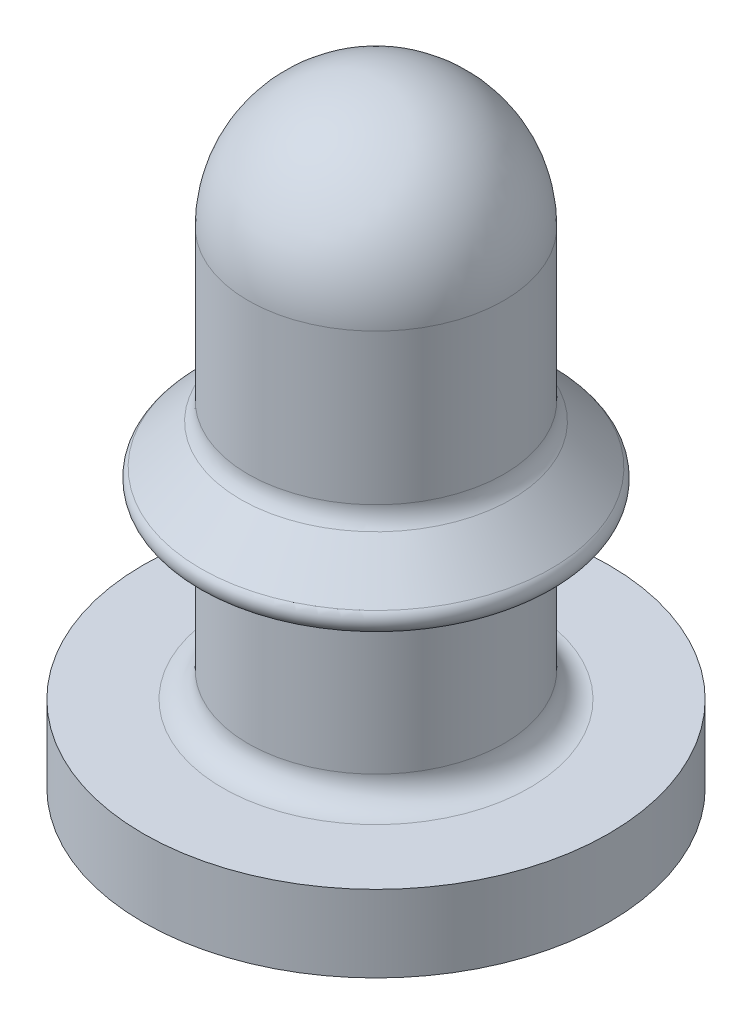
ISO-10303-21;
HEADER;
FILE_DESCRIPTION(('STEP AP214'),'2;1');
FILE_NAME('part.step','',(''),(''),'','','');
FILE_SCHEMA(('AUTOMOTIVE_DESIGN { 1 0 10303 214 1 1 1 1 }'));
ENDSEC;
DATA;
#1=APPLICATION_CONTEXT('core data for automotive mechanical design processes');
#2=APPLICATION_PROTOCOL_DEFINITION('international standard','automotive_design',2000,#1);
#3=PRODUCT_CONTEXT('',#1,'mechanical');
#4=PRODUCT('Part','Part','',(#3));
#5=PRODUCT_RELATED_PRODUCT_CATEGORY('part','',(#4));
#6=PRODUCT_DEFINITION_FORMATION('','',#4);
#7=PRODUCT_DEFINITION_CONTEXT('part definition',#1,'design');
#8=PRODUCT_DEFINITION('design','',#6,#7);
#9=PRODUCT_DEFINITION_SHAPE('','',#8);
#10=(LENGTH_UNIT() NAMED_UNIT(*) SI_UNIT(.MILLI.,.METRE.));
#11=(NAMED_UNIT(*) PLANE_ANGLE_UNIT() SI_UNIT($,.RADIAN.));
#12=(NAMED_UNIT(*) SI_UNIT($,.STERADIAN.) SOLID_ANGLE_UNIT());
#13=UNCERTAINTY_MEASURE_WITH_UNIT(LENGTH_MEASURE(1.E-05),#10,'distance_accuracy_value','');
#14=(GEOMETRIC_REPRESENTATION_CONTEXT(3) GLOBAL_UNCERTAINTY_ASSIGNED_CONTEXT((#13)) GLOBAL_UNIT_ASSIGNED_CONTEXT((#10,
#11,#12)) REPRESENTATION_CONTEXT('',''));
#15=CARTESIAN_POINT('',(0.,0.,0.));
#16=DIRECTION('',(0.,0.,1.));
#17=DIRECTION('',(1.,0.,0.));
#18=AXIS2_PLACEMENT_3D('',#15,#16,#17);
#19=CARTESIAN_POINT('',(0.,0.,0.));
#20=DIRECTION('',(0.,1.,0.));
#21=DIRECTION('',(0.,0.,1.));
#22=AXIS2_PLACEMENT_3D('',#19,#20,#21);
#23=PLANE('',#22);
#24=CARTESIAN_POINT('',(0.,0.,0.));
#25=DIRECTION('',(0.,-1.,0.));
#26=DIRECTION('',(0.,0.,-1.));
#27=AXIS2_PLACEMENT_3D('',#24,#25,#26);
#28=CIRCLE('',#27,4.55);
#29=CARTESIAN_POINT('',(0.,0.,-4.55));
#30=VERTEX_POINT('',#29);
#31=EDGE_CURVE('E222',#30,#30,#28,.T.);
#32=ORIENTED_EDGE('',*,*,#31,.T.);
#33=EDGE_LOOP('',(#32));
#34=FACE_BOUND('',#33,.T.);
#35=CARTESIAN_POINT('',(0.,0.,0.));
#36=DIRECTION('',(0.,1.,0.));
#37=DIRECTION('',(-1.,0.,0.));
#38=AXIS2_PLACEMENT_3D('',#35,#36,#37);
#39=CIRCLE('',#38,1.17455064928218);
#40=CARTESIAN_POINT('',(-0.778036246491997,0.,0.879902737166914));
#41=VERTEX_POINT('',#40);
#42=CARTESIAN_POINT('',(-0.37299999999999,0.,1.11375052311062));
#43=VERTEX_POINT('',#42);
#44=EDGE_CURVE('E120',#41,#43,#39,.T.);
#45=ORIENTED_EDGE('',*,*,#44,.T.);
#46=CARTESIAN_POINT('',(0.,0.,0.));
#47=DIRECTION('',(0.,1.,0.));
#48=DIRECTION('',(0.,0.,1.));
#49=AXIS2_PLACEMENT_3D('',#46,#47,#48);
#50=CIRCLE('',#49,1.17455064928218);
#51=CARTESIAN_POINT('',(1.15103624649201,0.,0.233847785943715));
#52=VERTEX_POINT('',#51);
#53=EDGE_CURVE('E230',#52,#43,#50,.F.);
#54=ORIENTED_EDGE('',*,*,#53,.F.);
#55=CARTESIAN_POINT('',(1.15103624649201,0.,-0.233847785943715));
#56=VERTEX_POINT('',#55);
#57=EDGE_CURVE('E600',#52,#56,#39,.T.);
#58=ORIENTED_EDGE('',*,*,#57,.T.);
#59=CARTESIAN_POINT('',(-0.373000000000006,0.,-1.11375052311062));
#60=VERTEX_POINT('',#59);
#61=EDGE_CURVE('E234',#60,#56,#50,.F.);
#62=ORIENTED_EDGE('',*,*,#61,.F.);
#63=CARTESIAN_POINT('',(-0.778036246492009,0.,-0.879902737166903));
#64=VERTEX_POINT('',#63);
#65=EDGE_CURVE('E598',#60,#64,#39,.T.);
#66=ORIENTED_EDGE('',*,*,#65,.T.);
#67=EDGE_CURVE('E233',#41,#64,#50,.F.);
#68=ORIENTED_EDGE('',*,*,#67,.F.);
#69=EDGE_LOOP('',(#45,#54,#58,#62,#66,#68));
#70=FACE_BOUND('',#69,.T.);
#71=ADVANCED_FACE('F41',(#34,#70),#23,.F.);
#72=CARTESIAN_POINT('',(0.746,-0.634345967878164,0.));
#73=DIRECTION('',(0.499999999999999,0.,0.866025403784439));
#74=DIRECTION('',(0.866025403784439,0.,-0.5));
#75=AXIS2_PLACEMENT_3D('',#72,#73,#74);
#76=PLANE('',#75);
#77=CARTESIAN_POINT('',(0.745832173779802,0.510926775890563,9.68945134081906E-05));
#78=CARTESIAN_POINT('',(0.78062302744479,0.469413521310681,-0.0199896142154092));
#79=CARTESIAN_POINT('',(0.815040850569823,0.427491240145489,-0.0398607536615681));
#80=CARTESIAN_POINT('',(0.883320839870301,0.343055748477382,-0.0792822238644636));
#81=CARTESIAN_POINT('',(0.917183070800882,0.300542607922312,-0.0988325920075956));
#82=CARTESIAN_POINT('',(0.984547959411344,0.215145709563048,-0.137725728580775));
#83=CARTESIAN_POINT('',(1.01805064251247,0.172261978353071,-0.157068511687784));
#84=CARTESIAN_POINT('',(1.08479437485192,0.0862148431036361,-0.195603023520688));
#85=CARTESIAN_POINT('',(1.11803539377236,0.0430514076824374,-0.214794734742543));
#86=CARTESIAN_POINT('',(1.15118951555644,-0.000200000000000043,-0.233936275879324));
#87=B_SPLINE_CURVE_WITH_KNOTS('',3,(#77,#78,#79,#80,#81,#82,#83,#84,#85,#86),.UNSPECIFIED.,.F.,
.F.,(4,2,2,2,4),(0.,0.173295083895832,0.346569824409935,0.519832232017379,0.693114427717982),.UNSPECIFIED.);
#88=CARTESIAN_POINT('',(0.746,0.510726775890617,0.));
#89=VERTEX_POINT('',#88);
#90=EDGE_CURVE('E134',#89,#56,#87,.T.);
#91=ORIENTED_EDGE('',*,*,#90,.F.);
#92=DIRECTION('',(0.,1.,0.));
#93=VECTOR('',#92,1.);
#94=CARTESIAN_POINT('',(0.746,-0.634345967878164,0.));
#95=LINE('',#94,#93);
#96=CARTESIAN_POINT('',(0.746,10.,0.));
#97=VERTEX_POINT('',#96);
#98=EDGE_CURVE('E583',#89,#97,#95,.T.);
#99=ORIENTED_EDGE('',*,*,#98,.T.);
#100=DIRECTION('',(0.866025403784439,0.,-0.499999999999999));
#101=VECTOR('',#100,1.);
#102=CARTESIAN_POINT('',(0.746,10.,0.));
#103=LINE('',#102,#101);
#104=CARTESIAN_POINT('',(0.990025512973919,10.,-0.140888195604629));
#105=VERTEX_POINT('',#104);
#106=EDGE_CURVE('E538',#97,#105,#103,.T.);
#107=ORIENTED_EDGE('',*,*,#106,.T.);
#108=CARTESIAN_POINT('',(0.990022254508027,10.0002,-0.140886314328468));
#109=CARTESIAN_POINT('',(1.00069504923594,9.34508688925258,-0.147048255237634));
#110=CARTESIAN_POINT('',(1.01133909204178,8.6899731550503,-0.153193596216853));
#111=CARTESIAN_POINT('',(1.04366157079037,6.69568649395237,-0.171854988023228));
#112=CARTESIAN_POINT('',(1.06525655933813,5.35651176341795,-0.184322860474423));
#113=CARTESIAN_POINT('',(1.10826984195247,2.678158493165,-0.20915659077054));
#114=CARTESIAN_POINT('',(1.12968813601583,1.33897995344638,-0.221522448613604));
#115=CARTESIAN_POINT('',(1.15103943484099,-0.000200000000002151,-0.23384962673786));
#116=B_SPLINE_CURVE_WITH_KNOTS('',3,(#108,#109,#110,#111,#112,#113,#114,#115),.UNSPECIFIED.,.F.,
.F.,(4,2,2,4),(0.,1.96568705114277,5.9839076269451,10.0021282759586),.UNSPECIFIED.);
#117=EDGE_CURVE('E250',#105,#56,#116,.T.);
#118=ORIENTED_EDGE('',*,*,#117,.T.);
#119=EDGE_LOOP('',(#91,#99,#107,#118));
#120=FACE_BOUND('',#119,.T.);
#121=ADVANCED_FACE('F281',(#120),#76,.F.);
#122=CARTESIAN_POINT('',(1.15103624649201,-0.634345967878164,0.233847785943715));
#123=DIRECTION('',(0.499999999999999,0.,-0.866025403784439));
#124=DIRECTION('',(-0.866025403784439,0.,-0.5));
#125=AXIS2_PLACEMENT_3D('',#122,#123,#124);
#126=PLANE('',#125);
#127=CARTESIAN_POINT('',(1.15118951555644,-0.000200000000000046,0.233936275879324));
#128=CARTESIAN_POINT('',(1.11803539377236,0.0430514076824375,0.214794734742543));
#129=CARTESIAN_POINT('',(1.08479437485192,0.0862148431036362,0.195603023520688));
#130=CARTESIAN_POINT('',(1.01805064251247,0.172261978353071,0.157068511687784));
#131=CARTESIAN_POINT('',(0.984547959411344,0.215145709563048,0.137725728580775));
#132=CARTESIAN_POINT('',(0.917183070800881,0.300542607922312,0.0988325920075955));
#133=CARTESIAN_POINT('',(0.883320839870301,0.343055748477382,0.0792822238644635));
#134=CARTESIAN_POINT('',(0.815040850569823,0.427491240145489,0.039860753661568));
#135=CARTESIAN_POINT('',(0.78062302744479,0.469413521310681,0.0199896142154091));
#136=CARTESIAN_POINT('',(0.745832173779802,0.510926775890563,-9.68945134083011E-05));
#137=B_SPLINE_CURVE_WITH_KNOTS('',3,(#127,#128,#129,#130,#131,#132,#133,#134,#135,#136),
.UNSPECIFIED.,.F.,.F.,(4,2,2,2,4),(0.,0.173282195700604,0.346544603308047,0.51981934382215,
0.693114427717982),.UNSPECIFIED.);
#138=EDGE_CURVE('E137',#52,#89,#137,.T.);
#139=ORIENTED_EDGE('',*,*,#138,.F.);
#140=CARTESIAN_POINT('',(1.15103943484099,-0.000200000000000005,0.23384962673786));
#141=CARTESIAN_POINT('',(1.13877209931924,0.769274269692697,0.226767077272138));
#142=CARTESIAN_POINT('',(1.12648207220744,1.53874805904156,0.219671426810789));
#143=CARTESIAN_POINT('',(1.09364534841472,3.59022138345183,0.200713135489759));
#144=CARTESIAN_POINT('',(1.07305163362991,4.87221991555815,0.188823348715135));
#145=CARTESIAN_POINT('',(1.03168220020468,7.43621308137909,0.164938695190854));
#146=CARTESIAN_POINT('',(1.01090648156167,8.71820771509364,0.152943828439709));
#147=CARTESIAN_POINT('',(0.990022254508027,10.0002,0.140886314328469));
#148=B_SPLINE_CURVE_WITH_KNOTS('',3,(#140,#141,#142,#143,#144,#145,#146,#147),.UNSPECIFIED.,.F.,
.F.,(4,2,2,4),(0.,2.30881392320579,6.15547107203241,10.002128275349),.UNSPECIFIED.);
#149=CARTESIAN_POINT('',(0.990025512973919,10.,0.140888195604629));
#150=VERTEX_POINT('',#149);
#151=EDGE_CURVE('E254',#52,#150,#148,.T.);
#152=ORIENTED_EDGE('',*,*,#151,.T.);
#153=DIRECTION('',(0.866025403784439,0.,0.5));
#154=VECTOR('',#153,1.);
#155=CARTESIAN_POINT('',(0.1865,10.,-0.323027475611595));
#156=LINE('',#155,#154);
#157=EDGE_CURVE('E125',#97,#150,#156,.T.);
#158=ORIENTED_EDGE('',*,*,#157,.F.);
#159=ORIENTED_EDGE('',*,*,#98,.F.);
#160=EDGE_LOOP('',(#139,#152,#158,#159));
#161=FACE_BOUND('',#160,.T.);
#162=ADVANCED_FACE('F287',(#161),#126,.F.);
#163=CARTESIAN_POINT('',(-0.373000000000003,-0.634345967878164,-0.64605495122319));
#164=DIRECTION('',(0.499999999999997,0.,-0.866025403784441));
#165=DIRECTION('',(-0.866025403784441,0.,-0.499999999999997));
#166=AXIS2_PLACEMENT_3D('',#163,#164,#165);
#167=PLANE('',#166);
#168=CARTESIAN_POINT('',(-0.372832173779806,0.510926775890563,-0.645958056709781));
#169=CARTESIAN_POINT('',(-0.407623027444793,0.469413521310681,-0.666044565438599));
#170=CARTESIAN_POINT('',(-0.442040850569827,0.427491240145488,-0.685915704884758));
#171=CARTESIAN_POINT('',(-0.510320839870304,0.343055748477382,-0.725337175087653));
#172=CARTESIAN_POINT('',(-0.544183070800885,0.300542607922311,-0.744887543230785));
#173=CARTESIAN_POINT('',(-0.611547959411348,0.215145709563048,-0.783780679803964));
#174=CARTESIAN_POINT('',(-0.645050642512471,0.172261978353071,-0.803123462910972));
#175=CARTESIAN_POINT('',(-0.711794374851926,0.0862148431036361,-0.841657974743876));
#176=CARTESIAN_POINT('',(-0.745035393772368,0.0430514076824375,-0.860849685965731));
#177=CARTESIAN_POINT('',(-0.778189515556442,-0.000200000000000034,-0.879991227102512));
#178=B_SPLINE_CURVE_WITH_KNOTS('',3,(#168,#169,#170,#171,#172,#173,#174,#175,#176,#177),
.UNSPECIFIED.,.F.,.F.,(4,2,2,2,4),(0.,0.173295083895832,0.346569824409935,0.519832232017378,
0.693114427717982),.UNSPECIFIED.);
#179=CARTESIAN_POINT('',(-0.373000000000003,0.510726775890617,-0.646054951223189));
#180=VERTEX_POINT('',#179);
#181=EDGE_CURVE('E561',#180,#64,#178,.T.);
#182=ORIENTED_EDGE('',*,*,#181,.F.);
#183=DIRECTION('',(0.,1.,0.));
#184=VECTOR('',#183,1.);
#185=CARTESIAN_POINT('',(-0.373000000000003,-0.634345967878164,-0.64605495122319));
#186=LINE('',#185,#184);
#187=CARTESIAN_POINT('',(-0.373000000000003,10.,-0.64605495122319));
#188=VERTEX_POINT('',#187);
#189=EDGE_CURVE('E593',#180,#188,#186,.T.);
#190=ORIENTED_EDGE('',*,*,#189,.T.);
#191=DIRECTION('',(-0.866025403784441,0.,-0.499999999999997));
#192=VECTOR('',#191,1.);
#193=CARTESIAN_POINT('',(-0.373000000000003,10.,-0.64605495122319));
#194=LINE('',#193,#192);
#195=CARTESIAN_POINT('',(-0.617025512973923,10.,-0.786943146827817));
#196=VERTEX_POINT('',#195);
#197=EDGE_CURVE('E540',#188,#196,#194,.T.);
#198=ORIENTED_EDGE('',*,*,#197,.T.);
#199=CARTESIAN_POINT('',(-0.61702225450803,10.0002,-0.786941265551657));
#200=CARTESIAN_POINT('',(-0.627695049235943,9.34508688925258,-0.793103206460823));
#201=CARTESIAN_POINT('',(-0.638339092041784,8.6899731550503,-0.799248547440041));
#202=CARTESIAN_POINT('',(-0.670661570790376,6.69568649395237,-0.817909939246416));
#203=CARTESIAN_POINT('',(-0.692256559338133,5.35651176341796,-0.830377811697611));
#204=CARTESIAN_POINT('',(-0.735269841952471,2.678158493165,-0.855211541993728));
#205=CARTESIAN_POINT('',(-0.756688136015831,1.33897995344638,-0.867577399836792));
#206=CARTESIAN_POINT('',(-0.778039434840996,-0.000200000000000418,-0.879904577961049));
#207=B_SPLINE_CURVE_WITH_KNOTS('',3,(#199,#200,#201,#202,#203,#204,#205,#206),.UNSPECIFIED.,.F.,
.F.,(4,2,2,4),(0.,1.96568705114277,5.9839076269451,10.0021282759586),.UNSPECIFIED.);
#208=EDGE_CURVE('E534',#196,#64,#207,.T.);
#209=ORIENTED_EDGE('',*,*,#208,.T.);
#210=EDGE_LOOP('',(#182,#190,#198,#209));
#211=FACE_BOUND('',#210,.T.);
#212=ADVANCED_FACE('F422',(#211),#167,.F.);
#213=CARTESIAN_POINT('',(-0.373000000000006,-0.634345967878164,-1.11375052311062));
#214=DIRECTION('',(-1.,0.,0.));
#215=DIRECTION('',(0.,0.,1.));
#216=AXIS2_PLACEMENT_3D('',#213,#214,#215);
#217=PLANE('',#216);
#218=CARTESIAN_POINT('',(-0.373000000000009,-0.692717860834459,-1.71573295806559));
#219=CARTESIAN_POINT('',(-0.373000000000009,-0.637982314820271,-1.66872814287783));
#220=CARTESIAN_POINT('',(-0.373000000000008,-0.583286531371047,-1.6216769002091));
#221=CARTESIAN_POINT('',(-0.373000000000008,-0.473955024942024,-1.52739971060393));
#222=CARTESIAN_POINT('',(-0.373000000000008,-0.419319408570085,-1.48017364006476));
#223=CARTESIAN_POINT('',(-0.373000000000007,-0.309140099182755,-1.38464127415956));
#224=CARTESIAN_POINT('',(-0.373000000000007,-0.253599228192289,-1.33633171964225));
#225=CARTESIAN_POINT('',(-0.373000000000006,-0.142778728350092,-1.23951941496388));
#226=CARTESIAN_POINT('',(-0.373000000000006,-0.0874989023487366,-1.19101689028722));
#227=CARTESIAN_POINT('',(-0.373000000000005,0.047433354573127,-1.07192226814768));
#228=CARTESIAN_POINT('',(-0.373000000000005,0.126929475218088,-1.0011520078253));
#229=CARTESIAN_POINT('',(-0.373000000000004,0.245483377349233,-0.893959617336739));
#230=CARTESIAN_POINT('',(-0.373000000000004,0.284953023076053,-0.857993755117586));
#231=CARTESIAN_POINT('',(-0.373000000000004,0.363476995096158,-0.785637320431593));
#232=CARTESIAN_POINT('',(-0.373000000000004,0.402531457999957,-0.749246896482959));
#233=CARTESIAN_POINT('',(-0.373000000000003,0.479474368049328,-0.676375393974261));
#234=CARTESIAN_POINT('',(-0.373000000000003,0.517371517098527,-0.639903566257511));
#235=CARTESIAN_POINT('',(-0.373000000000003,0.592295916031648,-0.565978110372193));
#236=CARTESIAN_POINT('',(-0.373000000000002,0.629321951027463,-0.528523249237642));
#237=CARTESIAN_POINT('',(-0.373000000000002,0.70160530509519,-0.452342810692076));
#238=CARTESIAN_POINT('',(-0.373000000000002,0.73687214971911,-0.413626528704611));
#239=CARTESIAN_POINT('',(-0.373000000000002,0.787439463512848,-0.353646236208304));
#240=CARTESIAN_POINT('',(-0.373000000000001,0.803889952198684,-0.333358019993639));
#241=CARTESIAN_POINT('',(-0.373000000000001,0.835633226521656,-0.291900915545603));
#242=CARTESIAN_POINT('',(-0.373000000000001,0.850926913226525,-0.270732733083402));
#243=CARTESIAN_POINT('',(-0.373000000000001,0.872104467392437,-0.238718112560676));
#244=CARTESIAN_POINT('',(-0.373000000000001,0.878686722055214,-0.228334495504679));
#245=CARTESIAN_POINT('',(-0.373000000000001,0.891351052806089,-0.207261329327618));
#246=CARTESIAN_POINT('',(-0.373000000000001,0.897433019748448,-0.196571714130268));
#247=CARTESIAN_POINT('',(-0.373000000000001,0.908923531846826,-0.174938541262553));
#248=CARTESIAN_POINT('',(-0.373,0.91433691757459,-0.163997584171897));
#249=CARTESIAN_POINT('',(-0.373,0.924385732316272,-0.141764567092971));
#250=CARTESIAN_POINT('',(-0.373,0.929021242487513,-0.130472543878023));
#251=CARTESIAN_POINT('',(-0.373,0.939745881571213,-0.100861483429928));
#252=CARTESIAN_POINT('',(-0.373,0.945116318478269,-0.0822691383535696));
#253=CARTESIAN_POINT('',(-0.373,0.952648821354859,-0.0444575228385258));
#254=CARTESIAN_POINT('',(-0.373,0.95481975869324,-0.0252401374716156));
#255=CARTESIAN_POINT('',(-0.373,0.955364038905663,0.00278977124327252));
#256=CARTESIAN_POINT('',(-0.373,0.955158771207176,0.0115903034254779));
#257=CARTESIAN_POINT('',(-0.372999999999999,0.954017201223955,0.0291651353423025));
#258=CARTESIAN_POINT('',(-0.372999999999999,0.953079160033097,0.0379393227746899));
#259=CARTESIAN_POINT('',(-0.372999999999999,0.951785876316641,0.0466629096112693));
#260=B_SPLINE_CURVE_WITH_KNOTS('',3,(#218,#219,#220,#221,#222,#223,#224,#225,#226,#227,#228,
#229,#230,#231,#232,#233,#234,#235,#236,#237,#238,#239,#240,#241,#242,#243,#244,#245,#246,#247,
#248,#249,#250,#251,#252,#253,#254,#255,#256,#257,#258,#259),.UNSPECIFIED.,.F.,.F.,(4,2,2,2,2,2,
2,2,2,2,2,2,2,2,2,2,2,2,2,2,4),(0.,0.2164461317967,0.433098134773876,0.65393092297144,
0.87455520050927,1.1938465815474,1.35403964721687,1.51417826184226,1.6719553139172,
1.82994072754367,1.98694870650787,2.06528423615063,2.14355810574037,2.18042964678276,
2.21730921072156,2.25390379514814,2.290494559211,2.34833038131065,2.40600553623216,
2.43238732554533,2.45883191098022),.UNSPECIFIED.);
#261=EDGE_CURVE('E130',#60,#180,#260,.T.);
#262=ORIENTED_EDGE('',*,*,#261,.F.);
#263=CARTESIAN_POINT('',(-0.373000000000007,-10.0111309830786,-1.2967149227196));
#264=CARTESIAN_POINT('',(-0.373000000000006,-9.1271760753092,-1.28065929748815));
#265=CARTESIAN_POINT('',(-0.373000000000006,-8.24322156593449,-1.26458164927668));
#266=CARTESIAN_POINT('',(-0.373000000000006,-5.5913593996239,-1.21627225652534));
#267=CARTESIAN_POINT('',(-0.373000000000006,-3.82345313430422,-1.18396406440799));
#268=CARTESIAN_POINT('',(-0.373000000000006,-0.287645380379976,-1.11908846758365));
#269=CARTESIAN_POINT('',(-0.373000000000005,1.48025610822464,-1.08652106287932));
#270=CARTESIAN_POINT('',(-0.373000000000005,6.04200659170321,-1.00205817430413));
#271=CARTESIAN_POINT('',(-0.373000000000005,8.8358510030148,-0.949914058008537));
#272=CARTESIAN_POINT('',(-0.373000000000004,13.0265987554407,-0.870692417478568));
#273=CARTESIAN_POINT('',(-0.373000000000004,14.4235115875078,-0.84411762514999));
#274=CARTESIAN_POINT('',(-0.373000000000004,17.2173284908806,-0.790509047136202));
#275=CARTESIAN_POINT('',(-0.373000000000004,18.6142325621859,-0.763475261433479));
#276=CARTESIAN_POINT('',(-0.373000000000004,20.0111309830786,-0.736150060711781));
#277=B_SPLINE_CURVE_WITH_KNOTS('',3,(#263,#264,#265,#266,#267,#268,#269,#270,#271,#272,#273,
#274,#275,#276),.UNSPECIFIED.,.F.,.F.,(4,2,2,2,2,2,4),(0.,2.65230212743744,7.95690647173484,
13.2615107617205,21.644503454796,25.8360001534922,30.0274970121252),.UNSPECIFIED.);
#278=CARTESIAN_POINT('',(-0.373000000000005,10.,-0.927831342432447));
#279=VERTEX_POINT('',#278);
#280=EDGE_CURVE('E531',#60,#279,#277,.T.);
#281=ORIENTED_EDGE('',*,*,#280,.T.);
#282=DIRECTION('',(0.,0.,1.));
#283=VECTOR('',#282,1.);
#284=CARTESIAN_POINT('',(-0.373000000000006,10.,-1.11375052311062));
#285=LINE('',#284,#283);
#286=EDGE_CURVE('E535',#279,#188,#285,.T.);
#287=ORIENTED_EDGE('',*,*,#286,.T.);
#288=ORIENTED_EDGE('',*,*,#189,.F.);
#289=EDGE_LOOP('',(#262,#281,#287,#288));
#290=FACE_BOUND('',#289,.T.);
#291=ADVANCED_FACE('F433',(#290),#217,.F.);
#292=CARTESIAN_POINT('',(-0.372999999999994,-0.634345967878164,0.646054951223195));
#293=DIRECTION('',(-1.,0.,0.));
#294=DIRECTION('',(0.,0.,1.));
#295=AXIS2_PLACEMENT_3D('',#292,#293,#294);
#296=PLANE('',#295);
#297=CARTESIAN_POINT('',(-0.373,0.951785876316641,-0.0466629096112641));
#298=CARTESIAN_POINT('',(-0.373,0.953238021238513,-0.036888221831748));
#299=CARTESIAN_POINT('',(-0.373,0.954239531011704,-0.0270481522044414));
#300=CARTESIAN_POINT('',(-0.372999999999999,0.955318752593,-0.00732866935976525));
#301=CARTESIAN_POINT('',(-0.372999999999999,0.955397484110461,0.0025506883589858));
#302=CARTESIAN_POINT('',(-0.372999999999999,0.954239257094542,0.0316385730660726));
#303=CARTESIAN_POINT('',(-0.372999999999999,0.951683090468329,0.0508049704037663));
#304=CARTESIAN_POINT('',(-0.372999999999999,0.942328582981768,0.093638557150165));
#305=CARTESIAN_POINT('',(-0.372999999999998,0.934551410896679,0.11708210485581));
#306=CARTESIAN_POINT('',(-0.372999999999998,0.920281227006125,0.151217967346193));
#307=CARTESIAN_POINT('',(-0.372999999999998,0.915053846433092,0.162484909939768));
#308=CARTESIAN_POINT('',(-0.372999999999998,0.903899786447091,0.184665522680107));
#309=CARTESIAN_POINT('',(-0.372999999999998,0.897973338662118,0.195579308322578));
#310=CARTESIAN_POINT('',(-0.372999999999997,0.878998086724124,0.228481341606784));
#311=CARTESIAN_POINT('',(-0.372999999999997,0.865056312769279,0.249950730384759));
#312=CARTESIAN_POINT('',(-0.372999999999997,0.835698308562498,0.291866254699172));
#313=CARTESIAN_POINT('',(-0.372999999999997,0.82028024677359,0.312311069953312));
#314=CARTESIAN_POINT('',(-0.372999999999996,0.78841757975919,0.352498425275946));
#315=CARTESIAN_POINT('',(-0.372999999999996,0.771969478168071,0.372238171606876));
#316=CARTESIAN_POINT('',(-0.372999999999996,0.738396472766843,0.411136102827138));
#317=CARTESIAN_POINT('',(-0.372999999999996,0.721271412211492,0.430294151191082));
#318=CARTESIAN_POINT('',(-0.372999999999995,0.668712391658437,0.487628465456537));
#319=CARTESIAN_POINT('',(-0.372999999999995,0.632540817534807,0.525125880109119));
#320=CARTESIAN_POINT('',(-0.372999999999994,0.559217137546307,0.598950844024621));
#321=CARTESIAN_POINT('',(-0.372999999999994,0.52206762320554,0.635281010577325));
#322=CARTESIAN_POINT('',(-0.372999999999993,0.435781370702162,0.718116184600016));
#323=CARTESIAN_POINT('',(-0.372999999999993,0.386413333403088,0.764379796418047));
#324=CARTESIAN_POINT('',(-0.372999999999992,0.287012828896631,0.856189797072363));
#325=CARTESIAN_POINT('',(-0.372999999999992,0.23698031255327,0.901736132317991));
#326=CARTESIAN_POINT('',(-0.372999999999991,0.0861363378528304,1.0377895711065));
#327=CARTESIAN_POINT('',(-0.37299999999999,-0.015302604356056,1.12759978530894));
#328=CARTESIAN_POINT('',(-0.372999999999988,-0.212619301058079,1.30074756639821));
#329=CARTESIAN_POINT('',(-0.372999999999988,-0.308449588437189,1.38413965629955));
#330=CARTESIAN_POINT('',(-0.372999999999987,-0.452437358812799,1.50880213300144));
#331=CARTESIAN_POINT('',(-0.372999999999986,-0.500437383379658,1.5502542491129));
#332=CARTESIAN_POINT('',(-0.372999999999986,-0.59652042546128,1.63306081021001));
#333=CARTESIAN_POINT('',(-0.372999999999985,-0.644603441780433,1.67441525658273));
#334=CARTESIAN_POINT('',(-0.372999999999985,-0.692717860834459,1.71573295806559));
#335=B_SPLINE_CURVE_WITH_KNOTS('',3,(#297,#298,#299,#300,#301,#302,#303,#304,#305,#306,#307,
#308,#309,#310,#311,#312,#313,#314,#315,#316,#317,#318,#319,#320,#321,#322,#323,#324,#325,#326,
#327,#328,#329,#330,#331,#332,#333,#334),.UNSPECIFIED.,.F.,.F.,(4,2,2,2,2,2,2,2,2,2,2,2,2,2,2,2,
2,2,4),(0.,0.0296315521141569,0.0592303570073771,0.11691262056438,0.190570443775207,
0.22781718269056,0.265051614805631,0.341739287907311,0.418523366689241,0.495583920768924,
0.572662423425231,0.728915752624541,0.884790029201378,1.08774815121393,1.29072136579354,
1.69715643478698,2.07825824974778,2.26852240962745,2.45878385099574),.UNSPECIFIED.);
#336=CARTESIAN_POINT('',(-0.372999999999994,0.510726775890617,0.646054951223195));
#337=VERTEX_POINT('',#336);
#338=EDGE_CURVE('E118',#337,#43,#335,.T.);
#339=ORIENTED_EDGE('',*,*,#338,.F.);
#340=DIRECTION('',(0.,1.,0.));
#341=VECTOR('',#340,1.);
#342=CARTESIAN_POINT('',(-0.372999999999994,-0.634345967878164,0.646054951223195));
#343=LINE('',#342,#341);
#344=CARTESIAN_POINT('',(-0.372999999999994,10.,0.646054951223195));
#345=VERTEX_POINT('',#344);
#346=EDGE_CURVE('E56',#337,#345,#343,.T.);
#347=ORIENTED_EDGE('',*,*,#346,.T.);
#348=DIRECTION('',(0.,0.,1.));
#349=VECTOR('',#348,1.);
#350=CARTESIAN_POINT('',(-0.372999999999994,10.,0.646054951223195));
#351=LINE('',#350,#349);
#352=CARTESIAN_POINT('',(-0.372999999999992,10.,0.927831342432452));
#353=VERTEX_POINT('',#352);
#354=EDGE_CURVE('E133',#345,#353,#351,.T.);
#355=ORIENTED_EDGE('',*,*,#354,.T.);
#356=CARTESIAN_POINT('',(-0.372999999999993,20.0111309830786,0.736150060711786));
#357=CARTESIAN_POINT('',(-0.372999999999993,19.4705014942492,0.746727436330468));
#358=CARTESIAN_POINT('',(-0.372999999999993,18.9298711409585,0.757260498380843));
#359=CARTESIAN_POINT('',(-0.372999999999993,16.2267153698212,0.809723017603835));
#360=CARTESIAN_POINT('',(-0.372999999999992,14.0641781370893,0.851044097784561));
#361=CARTESIAN_POINT('',(-0.372999999999992,10.0755845819967,0.926502978880246));
#362=CARTESIAN_POINT('',(-0.372999999999991,8.24953046579901,0.960758047227673));
#363=CARTESIAN_POINT('',(-0.372999999999991,4.5974142378981,1.02884026910536));
#364=CARTESIAN_POINT('',(-0.37299999999999,2.77135212619484,1.06266742263165));
#365=CARTESIAN_POINT('',(-0.37299999999999,-0.880777632585939,1.13000418057324));
#366=CARTESIAN_POINT('',(-0.37299999999999,-2.70684527966246,1.16351378504252));
#367=CARTESIAN_POINT('',(-0.372999999999989,-6.35898506844741,1.23028398074408));
#368=CARTESIAN_POINT('',(-0.372999999999989,-8.18505721015569,1.26354457198447));
#369=CARTESIAN_POINT('',(-0.372999999999988,-10.0111309830786,1.29671492271984));
#370=B_SPLINE_CURVE_WITH_KNOTS('',3,(#356,#357,#358,#359,#360,#361,#362,#363,#364,#365,#366,
#367,#368,#369),.UNSPECIFIED.,.F.,.F.,(4,2,2,2,2,2,4),(0.,1.62219884935815,8.11099444599522,
13.5901205598377,19.0692467245907,24.5483719578747,30.0274970126668),.UNSPECIFIED.);
#371=EDGE_CURVE('E129',#353,#43,#370,.T.);
#372=ORIENTED_EDGE('',*,*,#371,.T.);
#373=EDGE_LOOP('',(#339,#347,#355,#372));
#374=FACE_BOUND('',#373,.T.);
#375=ADVANCED_FACE('F128',(#374),#296,.F.);
#376=CARTESIAN_POINT('',(-0.778036246491997,-0.634345967878164,0.879902737166914));
#377=DIRECTION('',(0.500000000000009,0.,0.866025403784434));
#378=DIRECTION('',(0.866025403784434,0.,-0.500000000000009));
#379=AXIS2_PLACEMENT_3D('',#376,#377,#378);
#380=PLANE('',#379);
#381=CARTESIAN_POINT('',(-0.77818951555643,-0.0002,0.879991227102523));
#382=CARTESIAN_POINT('',(-0.745035393772356,0.0430514076824376,0.860849685965742));
#383=CARTESIAN_POINT('',(-0.711794374851914,0.0862148431036362,0.841657974743886));
#384=CARTESIAN_POINT('',(-0.64505064251246,0.172261978353071,0.803123462910981));
#385=CARTESIAN_POINT('',(-0.611547959411337,0.215145709563048,0.783780679803972));
#386=CARTESIAN_POINT('',(-0.544183070800875,0.300542607922312,0.744887543230792));
#387=CARTESIAN_POINT('',(-0.510320839870294,0.343055748477382,0.72533717508766));
#388=CARTESIAN_POINT('',(-0.442040850569817,0.427491240145489,0.685915704884764));
#389=CARTESIAN_POINT('',(-0.407623027444784,0.469413521310681,0.666044565438604));
#390=CARTESIAN_POINT('',(-0.372832173779797,0.510926775890563,0.645958056709787));
#391=B_SPLINE_CURVE_WITH_KNOTS('',3,(#381,#382,#383,#384,#385,#386,#387,#388,#389,#390),
.UNSPECIFIED.,.F.,.F.,(4,2,2,2,4),(0.,0.173282195700604,0.346544603308047,0.51981934382215,
0.693114427717982),.UNSPECIFIED.);
#392=EDGE_CURVE('E116',#41,#337,#391,.T.);
#393=ORIENTED_EDGE('',*,*,#392,.F.);
#394=CARTESIAN_POINT('',(-0.778039434840983,-0.0002,0.879904577961059));
#395=CARTESIAN_POINT('',(-0.765772099319233,0.769274269692698,0.872822028495337));
#396=CARTESIAN_POINT('',(-0.753482072207427,1.53874805904156,0.865726378033988));
#397=CARTESIAN_POINT('',(-0.72064534841471,3.59022138345183,0.846768086712957));
#398=CARTESIAN_POINT('',(-0.700051633629902,4.87221991555815,0.834878299938333));
#399=CARTESIAN_POINT('',(-0.658682200204669,7.43621308137909,0.810993646414052));
#400=CARTESIAN_POINT('',(-0.637906481561667,8.71820771509364,0.798998779662907));
#401=CARTESIAN_POINT('',(-0.61702225450802,10.0002,0.786941265551666));
#402=B_SPLINE_CURVE_WITH_KNOTS('',3,(#394,#395,#396,#397,#398,#399,#400,#401),.UNSPECIFIED.,.F.,
.F.,(4,2,2,4),(0.,2.30881392320579,6.15547107203241,10.002128275349),.UNSPECIFIED.);
#403=CARTESIAN_POINT('',(-0.617025512973912,10.,0.786943146827826));
#404=VERTEX_POINT('',#403);
#405=EDGE_CURVE('E148',#41,#404,#402,.T.);
#406=ORIENTED_EDGE('',*,*,#405,.T.);
#407=DIRECTION('',(0.866025403784434,0.,-0.500000000000009));
#408=VECTOR('',#407,1.);
#409=CARTESIAN_POINT('',(-0.778036246491997,10.,0.879902737166914));
#410=LINE('',#409,#408);
#411=EDGE_CURVE('E63',#404,#345,#410,.T.);
#412=ORIENTED_EDGE('',*,*,#411,.T.);
#413=ORIENTED_EDGE('',*,*,#346,.F.);
#414=EDGE_LOOP('',(#393,#406,#412,#413));
#415=FACE_BOUND('',#414,.T.);
#416=ADVANCED_FACE('F132',(#415),#380,.F.);
#417=CARTESIAN_POINT('',(0.,10.,0.));
#418=DIRECTION('',(0.,-1.,0.));
#419=DIRECTION('',(0.,0.,-1.));
#420=AXIS2_PLACEMENT_3D('',#417,#418,#419);
#421=CONICAL_SURFACE('',#420,1.,0.0174532925199433);
#422=ORIENTED_EDGE('',*,*,#371,.F.);
#423=CARTESIAN_POINT('',(0.,10.,0.));
#424=DIRECTION('',(0.,-1.,0.));
#425=DIRECTION('',(0.,0.,-1.));
#426=AXIS2_PLACEMENT_3D('',#423,#424,#425);
#427=CIRCLE('',#426,1.);
#428=EDGE_CURVE('E240',#150,#353,#427,.T.);
#429=ORIENTED_EDGE('',*,*,#428,.F.);
#430=ORIENTED_EDGE('',*,*,#151,.F.);
#431=ORIENTED_EDGE('',*,*,#53,.T.);
#432=EDGE_LOOP('',(#422,#429,#430,#431));
#433=FACE_BOUND('',#432,.T.);
#434=ADVANCED_FACE('F162',(#433),#421,.F.);
#435=ORIENTED_EDGE('',*,*,#405,.F.);
#436=ORIENTED_EDGE('',*,*,#67,.T.);
#437=ORIENTED_EDGE('',*,*,#208,.F.);
#438=EDGE_CURVE('E238',#404,#196,#427,.T.);
#439=ORIENTED_EDGE('',*,*,#438,.F.);
#440=EDGE_LOOP('',(#435,#436,#437,#439));
#441=FACE_BOUND('',#440,.T.);
#442=ADVANCED_FACE('F468',(#441),#421,.F.);
#443=CARTESIAN_POINT('',(0.,10.,0.));
#444=DIRECTION('',(0.,-1.,0.));
#445=DIRECTION('',(0.,0.,-1.));
#446=AXIS2_PLACEMENT_3D('',#443,#444,#445);
#447=PLANE('',#446);
#448=ORIENTED_EDGE('',*,*,#428,.T.);
#449=ORIENTED_EDGE('',*,*,#354,.F.);
#450=ORIENTED_EDGE('',*,*,#411,.F.);
#451=ORIENTED_EDGE('',*,*,#438,.T.);
#452=ORIENTED_EDGE('',*,*,#197,.F.);
#453=ORIENTED_EDGE('',*,*,#286,.F.);
#454=EDGE_CURVE('E232',#279,#105,#427,.T.);
#455=ORIENTED_EDGE('',*,*,#454,.T.);
#456=ORIENTED_EDGE('',*,*,#106,.F.);
#457=ORIENTED_EDGE('',*,*,#157,.T.);
#458=EDGE_LOOP('',(#448,#449,#450,#451,#452,#453,#455,#456,#457));
#459=FACE_BOUND('',#458,.T.);
#460=ADVANCED_FACE('F477',(#459),#447,.T.);
#461=ORIENTED_EDGE('',*,*,#280,.F.);
#462=ORIENTED_EDGE('',*,*,#61,.T.);
#463=ORIENTED_EDGE('',*,*,#117,.F.);
#464=ORIENTED_EDGE('',*,*,#454,.F.);
#465=EDGE_LOOP('',(#461,#462,#463,#464));
#466=FACE_BOUND('',#465,.T.);
#467=ADVANCED_FACE('F206',(#466),#421,.F.);
#468=CARTESIAN_POINT('',(0.,12.,0.));
#469=DIRECTION('',(0.,-1.,0.));
#470=DIRECTION('',(0.,0.,-1.));
#471=AXIS2_PLACEMENT_3D('',#468,#469,#470);
#472=CYLINDRICAL_SURFACE('',#471,2.5);
#473=CARTESIAN_POINT('',(0.,4.5,0.));
#474=DIRECTION('',(0.,-1.,0.));
#475=DIRECTION('',(0.,0.,-1.));
#476=AXIS2_PLACEMENT_3D('',#473,#474,#475);
#477=CIRCLE('',#476,2.5);
#478=CARTESIAN_POINT('',(0.,4.5,-2.5));
#479=VERTEX_POINT('',#478);
#480=EDGE_CURVE('E188',#479,#479,#477,.T.);
#481=ORIENTED_EDGE('',*,*,#480,.T.);
#482=EDGE_LOOP('',(#481));
#483=FACE_BOUND('',#482,.T.);
#484=CARTESIAN_POINT('',(0.,2.,0.));
#485=DIRECTION('',(0.,-1.,0.));
#486=DIRECTION('',(0.,0.,-1.));
#487=AXIS2_PLACEMENT_3D('',#484,#485,#486);
#488=CIRCLE('',#487,2.5);
#489=CARTESIAN_POINT('',(0.,2.,-2.5));
#490=VERTEX_POINT('',#489);
#491=EDGE_CURVE('E185',#490,#490,#488,.F.);
#492=ORIENTED_EDGE('',*,*,#491,.T.);
#493=EDGE_LOOP('',(#492));
#494=FACE_BOUND('',#493,.T.);
#495=ADVANCED_FACE('F202',(#483,#494),#472,.T.);
#496=CARTESIAN_POINT('',(0.,1.5,0.));
#497=DIRECTION('',(0.,-1.,0.));
#498=DIRECTION('',(0.,0.,-1.));
#499=AXIS2_PLACEMENT_3D('',#496,#497,#498);
#500=CYLINDRICAL_SURFACE('',#499,4.55);
#501=CARTESIAN_POINT('',(0.,1.5,0.));
#502=DIRECTION('',(0.,-1.,0.));
#503=DIRECTION('',(0.,0.,-1.));
#504=AXIS2_PLACEMENT_3D('',#501,#502,#503);
#505=CIRCLE('',#504,4.55);
#506=CARTESIAN_POINT('',(0.,1.5,-4.55));
#507=VERTEX_POINT('',#506);
#508=EDGE_CURVE('E220',#507,#507,#505,.T.);
#509=ORIENTED_EDGE('',*,*,#508,.T.);
#510=EDGE_LOOP('',(#509));
#511=FACE_BOUND('',#510,.T.);
#512=ORIENTED_EDGE('',*,*,#31,.F.);
#513=EDGE_LOOP('',(#512));
#514=FACE_BOUND('',#513,.T.);
#515=ADVANCED_FACE('F205',(#511,#514),#500,.T.);
#516=CARTESIAN_POINT('',(0.,1.5,0.));
#517=DIRECTION('',(0.,-1.,0.));
#518=DIRECTION('',(0.,0.,-1.));
#519=AXIS2_PLACEMENT_3D('',#516,#517,#518);
#520=PLANE('',#519);
#521=CARTESIAN_POINT('',(0.,1.5,0.));
#522=DIRECTION('',(0.,-1.,0.));
#523=DIRECTION('',(0.,0.,-1.));
#524=AXIS2_PLACEMENT_3D('',#521,#522,#523);
#525=CIRCLE('',#524,3.);
#526=CARTESIAN_POINT('',(0.,1.5,-3.));
#527=VERTEX_POINT('',#526);
#528=EDGE_CURVE('E11',#527,#527,#525,.T.);
#529=ORIENTED_EDGE('',*,*,#528,.T.);
#530=EDGE_LOOP('',(#529));
#531=FACE_BOUND('',#530,.T.);
#532=ORIENTED_EDGE('',*,*,#508,.F.);
#533=EDGE_LOOP('',(#532));
#534=FACE_BOUND('',#533,.T.);
#535=ADVANCED_FACE('F214',(#531,#534),#520,.F.);
#536=CARTESIAN_POINT('',(3.25,5.,0.));
#537=DIRECTION('',(0.,-1.,0.));
#538=DIRECTION('',(0.,0.,-1.));
#539=AXIS2_PLACEMENT_3D('',#536,#537,#538);
#540=PLANE('',#539);
#541=CARTESIAN_POINT('',(0.,5.,0.));
#542=DIRECTION('',(0.,-1.,0.));
#543=DIRECTION('',(0.,0.,-1.));
#544=AXIS2_PLACEMENT_3D('',#541,#542,#543);
#545=CIRCLE('',#544,3.);
#546=CARTESIAN_POINT('',(0.,5.,-3.));
#547=VERTEX_POINT('',#546);
#548=EDGE_CURVE('E49',#547,#547,#545,.F.);
#549=ORIENTED_EDGE('',*,*,#548,.T.);
#550=EDGE_LOOP('',(#549));
#551=FACE_BOUND('',#550,.T.);
#552=CARTESIAN_POINT('',(0.,5.,0.));
#553=DIRECTION('',(0.,-1.,0.));
#554=DIRECTION('',(0.,0.,-1.));
#555=AXIS2_PLACEMENT_3D('',#552,#553,#554);
#556=CIRCLE('',#555,3.25);
#557=CARTESIAN_POINT('',(0.,5.,-3.25));
#558=VERTEX_POINT('',#557);
#559=EDGE_CURVE('E226',#558,#558,#556,.T.);
#560=ORIENTED_EDGE('',*,*,#559,.T.);
#561=EDGE_LOOP('',(#560));
#562=FACE_BOUND('',#561,.T.);
#563=ADVANCED_FACE('F193',(#551,#562),#540,.T.);
#564=CARTESIAN_POINT('',(0.,5.25,0.));
#565=DIRECTION('',(0.,-1.,0.));
#566=DIRECTION('',(0.,0.,-1.));
#567=AXIS2_PLACEMENT_3D('',#564,#565,#566);
#568=TOROIDAL_SURFACE('',#567,3.25,0.25);
#569=CARTESIAN_POINT('',(0.,5.42677669529664,0.));
#570=DIRECTION('',(0.,-1.,0.));
#571=DIRECTION('',(0.,0.,-1.));
#572=AXIS2_PLACEMENT_3D('',#569,#570,#571);
#573=CIRCLE('',#572,3.42677669529664);
#574=CARTESIAN_POINT('',(0.,5.42677669529664,-3.42677669529664));
#575=VERTEX_POINT('',#574);
#576=EDGE_CURVE('E262',#575,#575,#573,.T.);
#577=ORIENTED_EDGE('',*,*,#576,.T.);
#578=EDGE_LOOP('',(#577));
#579=FACE_BOUND('',#578,.T.);
#580=ORIENTED_EDGE('',*,*,#559,.F.);
#581=EDGE_LOOP('',(#580));
#582=FACE_BOUND('',#581,.T.);
#583=ADVANCED_FACE('F269',(#579,#582),#568,.T.);
#584=CARTESIAN_POINT('',(0.,5.42677669529664,0.));
#585=DIRECTION('',(0.,-1.,0.));
#586=DIRECTION('',(0.,0.,-1.));
#587=AXIS2_PLACEMENT_3D('',#584,#585,#586);
#588=CONICAL_SURFACE('',#587,3.42677669529664,0.785398163397454);
#589=CARTESIAN_POINT('',(0.,6.20710678118654,0.));
#590=DIRECTION('',(0.,1.,0.));
#591=DIRECTION('',(0.,0.,1.));
#592=AXIS2_PLACEMENT_3D('',#589,#590,#591);
#593=CIRCLE('',#592,2.64644660940673);
#594=CARTESIAN_POINT('',(0.,6.20710678118654,2.64644660940673));
#595=VERTEX_POINT('',#594);
#596=EDGE_CURVE('E124',#595,#595,#593,.F.);
#597=ORIENTED_EDGE('',*,*,#596,.T.);
#598=EDGE_LOOP('',(#597));
#599=FACE_BOUND('',#598,.T.);
#600=ORIENTED_EDGE('',*,*,#576,.F.);
#601=EDGE_LOOP('',(#600));
#602=FACE_BOUND('',#601,.T.);
#603=ADVANCED_FACE('F271',(#599,#602),#588,.T.);
#604=CARTESIAN_POINT('',(0.,6.56066017177981,0.));
#605=DIRECTION('',(0.,-1.,0.));
#606=DIRECTION('',(0.,0.,-1.));
#607=AXIS2_PLACEMENT_3D('',#604,#605,#606);
#608=CIRCLE('',#607,2.5);
#609=CARTESIAN_POINT('',(0.,6.56066017177981,-2.5));
#610=VERTEX_POINT('',#609);
#611=EDGE_CURVE('E182',#610,#610,#608,.F.);
#612=ORIENTED_EDGE('',*,*,#611,.T.);
#613=EDGE_LOOP('',(#612));
#614=FACE_BOUND('',#613,.T.);
#615=CARTESIAN_POINT('',(0.,9.5,0.));
#616=DIRECTION('',(0.,-1.,0.));
#617=DIRECTION('',(1.,0.,0.));
#618=AXIS2_PLACEMENT_3D('',#615,#616,#617);
#619=CIRCLE('',#618,2.5);
#620=CARTESIAN_POINT('',(2.5,9.5,0.));
#621=VERTEX_POINT('',#620);
#622=EDGE_CURVE('E243',#621,#621,#619,.T.);
#623=ORIENTED_EDGE('',*,*,#622,.T.);
#624=EDGE_LOOP('',(#623));
#625=FACE_BOUND('',#624,.T.);
#626=ADVANCED_FACE('F207',(#614,#625),#472,.T.);
#627=CARTESIAN_POINT('',(0.,9.5,0.));
#628=DIRECTION('',(0.,-1.,0.));
#629=DIRECTION('',(1.,0.,0.));
#630=AXIS2_PLACEMENT_3D('',#627,#628,#629);
#631=SPHERICAL_SURFACE('',#630,2.5);
#632=CARTESIAN_POINT('',(0.,12.,0.));
#633=VERTEX_POINT('',#632);
#634=VERTEX_LOOP('',#633);
#635=FACE_BOUND('',#634,.T.);
#636=ORIENTED_EDGE('',*,*,#622,.F.);
#637=EDGE_LOOP('',(#636));
#638=FACE_BOUND('',#637,.T.);
#639=ADVANCED_FACE('F292',(#635,#638),#631,.T.);
#640=CARTESIAN_POINT('',(0.,0.,0.));
#641=DIRECTION('',(0.,-1.,0.));
#642=DIRECTION('',(1.,0.,0.));
#643=AXIS2_PLACEMENT_3D('',#640,#641,#642);
#644=CONICAL_SURFACE('',#643,1.17455064928218,0.69813170079773);
#645=ORIENTED_EDGE('',*,*,#338,.T.);
#646=ORIENTED_EDGE('',*,*,#44,.F.);
#647=ORIENTED_EDGE('',*,*,#392,.T.);
#648=EDGE_LOOP('',(#645,#646,#647));
#649=FACE_BOUND('',#648,.T.);
#650=ADVANCED_FACE('F117',(#649),#644,.F.);
#651=ORIENTED_EDGE('',*,*,#181,.T.);
#652=ORIENTED_EDGE('',*,*,#65,.F.);
#653=ORIENTED_EDGE('',*,*,#261,.T.);
#654=EDGE_LOOP('',(#651,#652,#653));
#655=FACE_BOUND('',#654,.T.);
#656=ADVANCED_FACE('F308',(#655),#644,.F.);
#657=ORIENTED_EDGE('',*,*,#90,.T.);
#658=ORIENTED_EDGE('',*,*,#57,.F.);
#659=ORIENTED_EDGE('',*,*,#138,.T.);
#660=EDGE_LOOP('',(#657,#658,#659));
#661=FACE_BOUND('',#660,.T.);
#662=ADVANCED_FACE('F168',(#661),#644,.F.);
#663=CARTESIAN_POINT('',(0.,6.56066017177981,0.));
#664=DIRECTION('',(0.,-1.,0.));
#665=DIRECTION('',(0.,0.,-1.));
#666=AXIS2_PLACEMENT_3D('',#663,#664,#665);
#667=TOROIDAL_SURFACE('',#666,3.,0.5);
#668=ORIENTED_EDGE('',*,*,#611,.F.);
#669=EDGE_LOOP('',(#668));
#670=FACE_BOUND('',#669,.T.);
#671=ORIENTED_EDGE('',*,*,#596,.F.);
#672=EDGE_LOOP('',(#671));
#673=FACE_BOUND('',#672,.T.);
#674=ADVANCED_FACE('F199',(#670,#673),#667,.F.);
#675=CARTESIAN_POINT('',(0.,4.5,0.));
#676=DIRECTION('',(0.,-1.,0.));
#677=DIRECTION('',(0.,0.,-1.));
#678=AXIS2_PLACEMENT_3D('',#675,#676,#677);
#679=TOROIDAL_SURFACE('',#678,3.,0.5);
#680=ORIENTED_EDGE('',*,*,#548,.F.);
#681=EDGE_LOOP('',(#680));
#682=FACE_BOUND('',#681,.T.);
#683=ORIENTED_EDGE('',*,*,#480,.F.);
#684=EDGE_LOOP('',(#683));
#685=FACE_BOUND('',#684,.T.);
#686=ADVANCED_FACE('F196',(#682,#685),#679,.F.);
#687=CARTESIAN_POINT('',(0.,2.,0.));
#688=DIRECTION('',(0.,-1.,0.));
#689=DIRECTION('',(0.,0.,-1.));
#690=AXIS2_PLACEMENT_3D('',#687,#688,#689);
#691=TOROIDAL_SURFACE('',#690,3.,0.5);
#692=ORIENTED_EDGE('',*,*,#491,.F.);
#693=EDGE_LOOP('',(#692));
#694=FACE_BOUND('',#693,.T.);
#695=ORIENTED_EDGE('',*,*,#528,.F.);
#696=EDGE_LOOP('',(#695));
#697=FACE_BOUND('',#696,.T.);
#698=ADVANCED_FACE('F43',(#694,#697),#691,.F.);
#699=CLOSED_SHELL('',(#71,#121,#162,#212,#291,#375,#416,#434,#442,#460,#467,#495,#515,#535,#563,
#583,#603,#626,#639,#650,#656,#662,#674,#686,#698));
#700=MANIFOLD_SOLID_BREP('B2',#699);
#701=ADVANCED_BREP_SHAPE_REPRESENTATION('',(#18,#700),#14);
#702=SHAPE_DEFINITION_REPRESENTATION(#9,#701);
ENDSEC;
END-ISO-10303-21;
